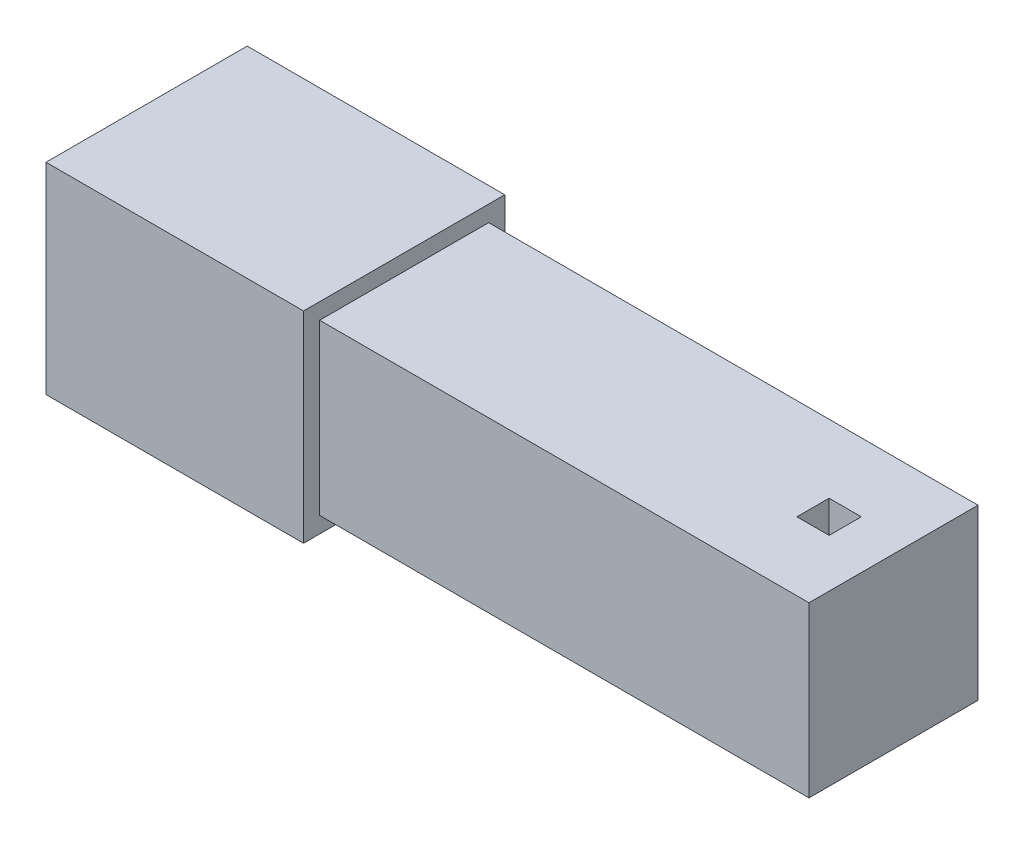
ISO-10303-21;
HEADER;
FILE_DESCRIPTION(('STEP AP214'),'2;1');
FILE_NAME('part.step','',(''),(''),'','','');
FILE_SCHEMA(('AUTOMOTIVE_DESIGN { 1 0 10303 214 1 1 1 1 }'));
ENDSEC;
DATA;
#1=APPLICATION_CONTEXT('core data for automotive mechanical design processes');
#2=APPLICATION_PROTOCOL_DEFINITION('international standard','automotive_design',2000,#1);
#3=PRODUCT_CONTEXT('',#1,'mechanical');
#4=PRODUCT('Part','Part','',(#3));
#5=PRODUCT_RELATED_PRODUCT_CATEGORY('part','',(#4));
#6=PRODUCT_DEFINITION_FORMATION('','',#4);
#7=PRODUCT_DEFINITION_CONTEXT('part definition',#1,'design');
#8=PRODUCT_DEFINITION('design','',#6,#7);
#9=PRODUCT_DEFINITION_SHAPE('','',#8);
#10=(LENGTH_UNIT() NAMED_UNIT(*) SI_UNIT(.MILLI.,.METRE.));
#11=(NAMED_UNIT(*) PLANE_ANGLE_UNIT() SI_UNIT($,.RADIAN.));
#12=(NAMED_UNIT(*) SI_UNIT($,.STERADIAN.) SOLID_ANGLE_UNIT());
#13=UNCERTAINTY_MEASURE_WITH_UNIT(LENGTH_MEASURE(1.E-05),#10,'distance_accuracy_value','');
#14=(GEOMETRIC_REPRESENTATION_CONTEXT(3) GLOBAL_UNCERTAINTY_ASSIGNED_CONTEXT((#13)) GLOBAL_UNIT_ASSIGNED_CONTEXT((#10,
#11,#12)) REPRESENTATION_CONTEXT('',''));
#15=CARTESIAN_POINT('',(0.,0.,0.));
#16=DIRECTION('',(0.,0.,1.));
#17=DIRECTION('',(1.,0.,0.));
#18=AXIS2_PLACEMENT_3D('',#15,#16,#17);
#19=CARTESIAN_POINT('',(-160.,0.,0.));
#20=DIRECTION('',(-1.,0.,0.));
#21=DIRECTION('',(0.,0.,1.));
#22=AXIS2_PLACEMENT_3D('',#19,#20,#21);
#23=PLANE('',#22);
#24=DIRECTION('',(0.,1.,0.));
#25=VECTOR('',#24,1.);
#26=CARTESIAN_POINT('',(-160.,0.,62.5));
#27=LINE('',#26,#25);
#28=CARTESIAN_POINT('',(-160.,-62.5,62.5));
#29=VERTEX_POINT('',#28);
#30=CARTESIAN_POINT('',(-160.,62.5,62.5));
#31=VERTEX_POINT('',#30);
#32=EDGE_CURVE('E180',#29,#31,#27,.T.);
#33=ORIENTED_EDGE('',*,*,#32,.T.);
#34=DIRECTION('',(0.,0.,-1.));
#35=VECTOR('',#34,1.);
#36=CARTESIAN_POINT('',(-160.,62.5,0.));
#37=LINE('',#36,#35);
#38=CARTESIAN_POINT('',(-160.,62.5,-62.5));
#39=VERTEX_POINT('',#38);
#40=EDGE_CURVE('E183',#31,#39,#37,.T.);
#41=ORIENTED_EDGE('',*,*,#40,.T.);
#42=DIRECTION('',(0.,-1.,0.));
#43=VECTOR('',#42,1.);
#44=CARTESIAN_POINT('',(-160.,0.,-62.5));
#45=LINE('',#44,#43);
#46=CARTESIAN_POINT('',(-160.,-62.5,-62.5));
#47=VERTEX_POINT('',#46);
#48=EDGE_CURVE('E186',#39,#47,#45,.T.);
#49=ORIENTED_EDGE('',*,*,#48,.T.);
#50=DIRECTION('',(0.,0.,1.));
#51=VECTOR('',#50,1.);
#52=CARTESIAN_POINT('',(-160.,-62.5,0.));
#53=LINE('',#52,#51);
#54=EDGE_CURVE('E188',#47,#29,#53,.T.);
#55=ORIENTED_EDGE('',*,*,#54,.T.);
#56=EDGE_LOOP('',(#33,#41,#49,#55));
#57=FACE_BOUND('',#56,.T.);
#58=DIRECTION('',(0.,0.,-1.));
#59=VECTOR('',#58,1.);
#60=CARTESIAN_POINT('',(-160.,52.5,-52.5));
#61=LINE('',#60,#59);
#62=CARTESIAN_POINT('',(-160.,52.5,52.5));
#63=VERTEX_POINT('',#62);
#64=CARTESIAN_POINT('',(-160.,52.5,-52.5));
#65=VERTEX_POINT('',#64);
#66=EDGE_CURVE('E152',#63,#65,#61,.T.);
#67=ORIENTED_EDGE('',*,*,#66,.F.);
#68=DIRECTION('',(0.,1.,0.));
#69=VECTOR('',#68,1.);
#70=CARTESIAN_POINT('',(-160.,-52.5,52.5));
#71=LINE('',#70,#69);
#72=CARTESIAN_POINT('',(-160.,-52.5,52.5));
#73=VERTEX_POINT('',#72);
#74=EDGE_CURVE('E144',#73,#63,#71,.T.);
#75=ORIENTED_EDGE('',*,*,#74,.F.);
#76=DIRECTION('',(0.,0.,1.));
#77=VECTOR('',#76,1.);
#78=CARTESIAN_POINT('',(-160.,-52.5,-52.5));
#79=LINE('',#78,#77);
#80=CARTESIAN_POINT('',(-160.,-52.5,-52.5));
#81=VERTEX_POINT('',#80);
#82=EDGE_CURVE('E166',#81,#73,#79,.T.);
#83=ORIENTED_EDGE('',*,*,#82,.F.);
#84=DIRECTION('',(0.,-1.,0.));
#85=VECTOR('',#84,1.);
#86=CARTESIAN_POINT('',(-160.,-52.5,-52.5));
#87=LINE('',#86,#85);
#88=EDGE_CURVE('E164',#65,#81,#87,.T.);
#89=ORIENTED_EDGE('',*,*,#88,.F.);
#90=EDGE_LOOP('',(#67,#75,#83,#89));
#91=FACE_BOUND('',#90,.T.);
#92=ADVANCED_FACE('F79',(#57,#91),#23,.T.);
#93=CARTESIAN_POINT('',(0.,0.,0.));
#94=DIRECTION('',(-1.,0.,0.));
#95=DIRECTION('',(0.,0.,1.));
#96=AXIS2_PLACEMENT_3D('',#93,#94,#95);
#97=PLANE('',#96);
#98=DIRECTION('',(0.,1.,0.));
#99=VECTOR('',#98,1.);
#100=CARTESIAN_POINT('',(0.,0.,62.5));
#101=LINE('',#100,#99);
#102=CARTESIAN_POINT('',(0.,-62.5,62.5));
#103=VERTEX_POINT('',#102);
#104=CARTESIAN_POINT('',(0.,62.5,62.5));
#105=VERTEX_POINT('',#104);
#106=EDGE_CURVE('E160',#103,#105,#101,.T.);
#107=ORIENTED_EDGE('',*,*,#106,.F.);
#108=DIRECTION('',(0.,0.,1.));
#109=VECTOR('',#108,1.);
#110=CARTESIAN_POINT('',(0.,-62.5,0.));
#111=LINE('',#110,#109);
#112=CARTESIAN_POINT('',(0.,-62.5,-62.5));
#113=VERTEX_POINT('',#112);
#114=EDGE_CURVE('E184',#113,#103,#111,.T.);
#115=ORIENTED_EDGE('',*,*,#114,.F.);
#116=DIRECTION('',(0.,-1.,0.));
#117=VECTOR('',#116,1.);
#118=CARTESIAN_POINT('',(0.,0.,-62.5));
#119=LINE('',#118,#117);
#120=CARTESIAN_POINT('',(0.,62.5,-62.5));
#121=VERTEX_POINT('',#120);
#122=EDGE_CURVE('E195',#121,#113,#119,.T.);
#123=ORIENTED_EDGE('',*,*,#122,.F.);
#124=DIRECTION('',(0.,0.,-1.));
#125=VECTOR('',#124,1.);
#126=CARTESIAN_POINT('',(0.,62.5,0.));
#127=LINE('',#126,#125);
#128=EDGE_CURVE('E193',#105,#121,#127,.T.);
#129=ORIENTED_EDGE('',*,*,#128,.F.);
#130=EDGE_LOOP('',(#107,#115,#123,#129));
#131=FACE_BOUND('',#130,.T.);
#132=DIRECTION('',(0.,1.,0.));
#133=VECTOR('',#132,1.);
#134=CARTESIAN_POINT('',(0.,-52.5,52.5));
#135=LINE('',#134,#133);
#136=CARTESIAN_POINT('',(0.,-52.5,52.5));
#137=VERTEX_POINT('',#136);
#138=CARTESIAN_POINT('',(0.,52.5,52.5));
#139=VERTEX_POINT('',#138);
#140=EDGE_CURVE('E102',#137,#139,#135,.T.);
#141=ORIENTED_EDGE('',*,*,#140,.T.);
#142=DIRECTION('',(0.,0.,-1.));
#143=VECTOR('',#142,1.);
#144=CARTESIAN_POINT('',(0.,52.5,-52.5));
#145=LINE('',#144,#143);
#146=CARTESIAN_POINT('',(0.,52.5,-52.5));
#147=VERTEX_POINT('',#146);
#148=EDGE_CURVE('E159',#139,#147,#145,.T.);
#149=ORIENTED_EDGE('',*,*,#148,.T.);
#150=DIRECTION('',(0.,-1.,0.));
#151=VECTOR('',#150,1.);
#152=CARTESIAN_POINT('',(0.,-52.5,-52.5));
#153=LINE('',#152,#151);
#154=CARTESIAN_POINT('',(0.,-52.5,-52.5));
#155=VERTEX_POINT('',#154);
#156=EDGE_CURVE('E172',#147,#155,#153,.T.);
#157=ORIENTED_EDGE('',*,*,#156,.T.);
#158=DIRECTION('',(0.,0.,1.));
#159=VECTOR('',#158,1.);
#160=CARTESIAN_POINT('',(0.,-52.5,-52.5));
#161=LINE('',#160,#159);
#162=EDGE_CURVE('E153',#155,#137,#161,.T.);
#163=ORIENTED_EDGE('',*,*,#162,.T.);
#164=EDGE_LOOP('',(#141,#149,#157,#163));
#165=FACE_BOUND('',#164,.T.);
#166=ADVANCED_FACE('F213',(#131,#165),#97,.F.);
#167=CARTESIAN_POINT('',(-160.,0.,62.5));
#168=DIRECTION('',(0.,0.,-1.));
#169=DIRECTION('',(-1.,0.,0.));
#170=AXIS2_PLACEMENT_3D('',#167,#168,#169);
#171=PLANE('',#170);
#172=ORIENTED_EDGE('',*,*,#106,.T.);
#173=DIRECTION('',(1.,0.,0.));
#174=VECTOR('',#173,1.);
#175=CARTESIAN_POINT('',(-160.,62.5,62.5));
#176=LINE('',#175,#174);
#177=EDGE_CURVE('E13',#31,#105,#176,.T.);
#178=ORIENTED_EDGE('',*,*,#177,.F.);
#179=ORIENTED_EDGE('',*,*,#32,.F.);
#180=DIRECTION('',(1.,0.,0.));
#181=VECTOR('',#180,1.);
#182=CARTESIAN_POINT('',(-160.,-62.5,62.5));
#183=LINE('',#182,#181);
#184=EDGE_CURVE('E190',#29,#103,#183,.T.);
#185=ORIENTED_EDGE('',*,*,#184,.T.);
#186=EDGE_LOOP('',(#172,#178,#179,#185));
#187=FACE_BOUND('',#186,.T.);
#188=ADVANCED_FACE('F81',(#187),#171,.F.);
#189=CARTESIAN_POINT('',(-160.,62.5,0.));
#190=DIRECTION('',(0.,-1.,0.));
#191=DIRECTION('',(0.,0.,-1.));
#192=AXIS2_PLACEMENT_3D('',#189,#190,#191);
#193=PLANE('',#192);
#194=ORIENTED_EDGE('',*,*,#128,.T.);
#195=DIRECTION('',(1.,0.,0.));
#196=VECTOR('',#195,1.);
#197=CARTESIAN_POINT('',(-160.,62.5,-62.5));
#198=LINE('',#197,#196);
#199=EDGE_CURVE('E87',#39,#121,#198,.T.);
#200=ORIENTED_EDGE('',*,*,#199,.F.);
#201=ORIENTED_EDGE('',*,*,#40,.F.);
#202=ORIENTED_EDGE('',*,*,#177,.T.);
#203=EDGE_LOOP('',(#194,#200,#201,#202));
#204=FACE_BOUND('',#203,.T.);
#205=ADVANCED_FACE('F223',(#204),#193,.F.);
#206=CARTESIAN_POINT('',(-160.,0.,-62.5));
#207=DIRECTION('',(0.,0.,1.));
#208=DIRECTION('',(1.,0.,0.));
#209=AXIS2_PLACEMENT_3D('',#206,#207,#208);
#210=PLANE('',#209);
#211=ORIENTED_EDGE('',*,*,#122,.T.);
#212=DIRECTION('',(1.,0.,0.));
#213=VECTOR('',#212,1.);
#214=CARTESIAN_POINT('',(-160.,-62.5,-62.5));
#215=LINE('',#214,#213);
#216=EDGE_CURVE('E200',#47,#113,#215,.T.);
#217=ORIENTED_EDGE('',*,*,#216,.F.);
#218=ORIENTED_EDGE('',*,*,#48,.F.);
#219=ORIENTED_EDGE('',*,*,#199,.T.);
#220=EDGE_LOOP('',(#211,#217,#218,#219));
#221=FACE_BOUND('',#220,.T.);
#222=ADVANCED_FACE('F207',(#221),#210,.F.);
#223=CARTESIAN_POINT('',(-160.,-62.5,0.));
#224=DIRECTION('',(0.,1.,0.));
#225=DIRECTION('',(0.,0.,1.));
#226=AXIS2_PLACEMENT_3D('',#223,#224,#225);
#227=PLANE('',#226);
#228=ORIENTED_EDGE('',*,*,#114,.T.);
#229=ORIENTED_EDGE('',*,*,#184,.F.);
#230=ORIENTED_EDGE('',*,*,#54,.F.);
#231=ORIENTED_EDGE('',*,*,#216,.T.);
#232=EDGE_LOOP('',(#228,#229,#230,#231));
#233=FACE_BOUND('',#232,.T.);
#234=ADVANCED_FACE('F217',(#233),#227,.F.);
#235=CARTESIAN_POINT('',(-160.,-52.5,52.5));
#236=DIRECTION('',(0.,0.,-1.));
#237=DIRECTION('',(-1.,0.,0.));
#238=AXIS2_PLACEMENT_3D('',#235,#236,#237);
#239=PLANE('',#238);
#240=ORIENTED_EDGE('',*,*,#140,.F.);
#241=DIRECTION('',(1.,0.,0.));
#242=VECTOR('',#241,1.);
#243=CARTESIAN_POINT('',(-160.,-52.5,52.5));
#244=LINE('',#243,#242);
#245=EDGE_CURVE('E148',#73,#137,#244,.T.);
#246=ORIENTED_EDGE('',*,*,#245,.F.);
#247=ORIENTED_EDGE('',*,*,#74,.T.);
#248=DIRECTION('',(1.,0.,0.));
#249=VECTOR('',#248,1.);
#250=CARTESIAN_POINT('',(-160.,52.5,52.5));
#251=LINE('',#250,#249);
#252=EDGE_CURVE('E147',#63,#139,#251,.T.);
#253=ORIENTED_EDGE('',*,*,#252,.T.);
#254=EDGE_LOOP('',(#240,#246,#247,#253));
#255=FACE_BOUND('',#254,.T.);
#256=ADVANCED_FACE('F146',(#255),#239,.T.);
#257=CARTESIAN_POINT('',(-160.,52.5,-52.5));
#258=DIRECTION('',(0.,-1.,0.));
#259=DIRECTION('',(0.,0.,-1.));
#260=AXIS2_PLACEMENT_3D('',#257,#258,#259);
#261=PLANE('',#260);
#262=ORIENTED_EDGE('',*,*,#148,.F.);
#263=ORIENTED_EDGE('',*,*,#252,.F.);
#264=ORIENTED_EDGE('',*,*,#66,.T.);
#265=DIRECTION('',(1.,0.,0.));
#266=VECTOR('',#265,1.);
#267=CARTESIAN_POINT('',(-160.,52.5,-52.5));
#268=LINE('',#267,#266);
#269=EDGE_CURVE('E161',#65,#147,#268,.T.);
#270=ORIENTED_EDGE('',*,*,#269,.T.);
#271=EDGE_LOOP('',(#262,#263,#264,#270));
#272=FACE_BOUND('',#271,.T.);
#273=ADVANCED_FACE('F156',(#272),#261,.T.);
#274=CARTESIAN_POINT('',(-160.,-52.5,-52.5));
#275=DIRECTION('',(0.,0.,1.));
#276=DIRECTION('',(1.,0.,0.));
#277=AXIS2_PLACEMENT_3D('',#274,#275,#276);
#278=PLANE('',#277);
#279=ORIENTED_EDGE('',*,*,#156,.F.);
#280=ORIENTED_EDGE('',*,*,#269,.F.);
#281=ORIENTED_EDGE('',*,*,#88,.T.);
#282=DIRECTION('',(1.,0.,0.));
#283=VECTOR('',#282,1.);
#284=CARTESIAN_POINT('',(-160.,-52.5,-52.5));
#285=LINE('',#284,#283);
#286=EDGE_CURVE('E94',#81,#155,#285,.T.);
#287=ORIENTED_EDGE('',*,*,#286,.T.);
#288=EDGE_LOOP('',(#279,#280,#281,#287));
#289=FACE_BOUND('',#288,.T.);
#290=ADVANCED_FACE('F246',(#289),#278,.T.);
#291=CARTESIAN_POINT('',(-160.,-52.5,-52.5));
#292=DIRECTION('',(0.,1.,0.));
#293=DIRECTION('',(0.,0.,1.));
#294=AXIS2_PLACEMENT_3D('',#291,#292,#293);
#295=PLANE('',#294);
#296=ORIENTED_EDGE('',*,*,#162,.F.);
#297=ORIENTED_EDGE('',*,*,#286,.F.);
#298=ORIENTED_EDGE('',*,*,#82,.T.);
#299=ORIENTED_EDGE('',*,*,#245,.T.);
#300=EDGE_LOOP('',(#296,#297,#298,#299));
#301=FACE_BOUND('',#300,.T.);
#302=ADVANCED_FACE('F250',(#301),#295,.T.);
#303=CLOSED_SHELL('',(#92,#166,#188,#205,#222,#234,#256,#273,#290,#302));
#304=MANIFOLD_SOLID_BREP('B2',#303);
#305=CARTESIAN_POINT('',(304.,52.5,52.5));
#306=DIRECTION('',(0.,1.,0.));
#307=DIRECTION('',(0.,0.,1.));
#308=AXIS2_PLACEMENT_3D('',#305,#306,#307);
#309=PLANE('',#308);
#310=DIRECTION('',(0.,0.,-1.));
#311=VECTOR('',#310,1.);
#312=CARTESIAN_POINT('',(274.,52.5,52.5));
#313=LINE('',#312,#311);
#314=CARTESIAN_POINT('',(274.,52.5,9.99999999999999));
#315=VERTEX_POINT('',#314);
#316=CARTESIAN_POINT('',(274.,52.5,-10.));
#317=VERTEX_POINT('',#316);
#318=EDGE_CURVE('E442',#315,#317,#313,.T.);
#319=ORIENTED_EDGE('',*,*,#318,.F.);
#320=DIRECTION('',(1.,0.,0.));
#321=VECTOR('',#320,1.);
#322=CARTESIAN_POINT('',(304.,52.5,9.99999999999999));
#323=LINE('',#322,#321);
#324=CARTESIAN_POINT('',(254.,52.5,9.99999999999999));
#325=VERTEX_POINT('',#324);
#326=EDGE_CURVE('E430',#325,#315,#323,.T.);
#327=ORIENTED_EDGE('',*,*,#326,.F.);
#328=DIRECTION('',(0.,0.,1.));
#329=VECTOR('',#328,1.);
#330=CARTESIAN_POINT('',(254.,52.5,52.5));
#331=LINE('',#330,#329);
#332=CARTESIAN_POINT('',(254.,52.5,-10.));
#333=VERTEX_POINT('',#332);
#334=EDGE_CURVE('E405',#333,#325,#331,.T.);
#335=ORIENTED_EDGE('',*,*,#334,.F.);
#336=DIRECTION('',(-1.,0.,0.));
#337=VECTOR('',#336,1.);
#338=CARTESIAN_POINT('',(304.,52.5,-10.));
#339=LINE('',#338,#337);
#340=EDGE_CURVE('E439',#317,#333,#339,.T.);
#341=ORIENTED_EDGE('',*,*,#340,.F.);
#342=EDGE_LOOP('',(#319,#327,#335,#341));
#343=FACE_BOUND('',#342,.T.);
#344=DIRECTION('',(0.,0.,-1.));
#345=VECTOR('',#344,1.);
#346=CARTESIAN_POINT('',(0.,52.5,52.5));
#347=LINE('',#346,#345);
#348=CARTESIAN_POINT('',(0.,52.5,52.5));
#349=VERTEX_POINT('',#348);
#350=CARTESIAN_POINT('',(0.,52.5,-52.5));
#351=VERTEX_POINT('',#350);
#352=EDGE_CURVE('E490',#349,#351,#347,.T.);
#353=ORIENTED_EDGE('',*,*,#352,.F.);
#354=DIRECTION('',(-1.,0.,0.));
#355=VECTOR('',#354,1.);
#356=CARTESIAN_POINT('',(304.,52.5,52.5));
#357=LINE('',#356,#355);
#358=CARTESIAN_POINT('',(304.,52.5,52.5));
#359=VERTEX_POINT('',#358);
#360=EDGE_CURVE('E77',#359,#349,#357,.T.);
#361=ORIENTED_EDGE('',*,*,#360,.F.);
#362=DIRECTION('',(0.,0.,-1.));
#363=VECTOR('',#362,1.);
#364=CARTESIAN_POINT('',(304.,52.5,52.5));
#365=LINE('',#364,#363);
#366=CARTESIAN_POINT('',(304.,52.5,-52.5));
#367=VERTEX_POINT('',#366);
#368=EDGE_CURVE('E491',#359,#367,#365,.T.);
#369=ORIENTED_EDGE('',*,*,#368,.T.);
#370=DIRECTION('',(-1.,0.,0.));
#371=VECTOR('',#370,1.);
#372=CARTESIAN_POINT('',(304.,52.5,-52.5));
#373=LINE('',#372,#371);
#374=EDGE_CURVE('E312',#367,#351,#373,.T.);
#375=ORIENTED_EDGE('',*,*,#374,.T.);
#376=EDGE_LOOP('',(#353,#361,#369,#375));
#377=FACE_BOUND('',#376,.T.);
#378=ADVANCED_FACE('F309',(#343,#377),#309,.T.);
#379=CARTESIAN_POINT('',(304.,52.5,52.5));
#380=DIRECTION('',(0.,0.,-1.));
#381=DIRECTION('',(0.,1.,0.));
#382=AXIS2_PLACEMENT_3D('',#379,#380,#381);
#383=PLANE('',#382);
#384=DIRECTION('',(0.,-1.,0.));
#385=VECTOR('',#384,1.);
#386=CARTESIAN_POINT('',(0.,52.5,52.5));
#387=LINE('',#386,#385);
#388=CARTESIAN_POINT('',(0.,-52.5,52.5));
#389=VERTEX_POINT('',#388);
#390=EDGE_CURVE('E496',#349,#389,#387,.T.);
#391=ORIENTED_EDGE('',*,*,#390,.T.);
#392=DIRECTION('',(-1.,0.,0.));
#393=VECTOR('',#392,1.);
#394=CARTESIAN_POINT('',(304.,-52.5,52.5));
#395=LINE('',#394,#393);
#396=CARTESIAN_POINT('',(304.,-52.5,52.5));
#397=VERTEX_POINT('',#396);
#398=EDGE_CURVE('E318',#397,#389,#395,.T.);
#399=ORIENTED_EDGE('',*,*,#398,.F.);
#400=DIRECTION('',(0.,-1.,0.));
#401=VECTOR('',#400,1.);
#402=CARTESIAN_POINT('',(304.,52.5,52.5));
#403=LINE('',#402,#401);
#404=EDGE_CURVE('E503',#359,#397,#403,.T.);
#405=ORIENTED_EDGE('',*,*,#404,.F.);
#406=ORIENTED_EDGE('',*,*,#360,.T.);
#407=EDGE_LOOP('',(#391,#399,#405,#406));
#408=FACE_BOUND('',#407,.T.);
#409=ADVANCED_FACE('F538',(#408),#383,.F.);
#410=CARTESIAN_POINT('',(304.,-52.5,52.5));
#411=DIRECTION('',(0.,1.,0.));
#412=DIRECTION('',(0.,0.,1.));
#413=AXIS2_PLACEMENT_3D('',#410,#411,#412);
#414=PLANE('',#413);
#415=DIRECTION('',(-1.,0.,0.));
#416=VECTOR('',#415,1.);
#417=CARTESIAN_POINT('',(254.,-52.5,9.99999999999999));
#418=LINE('',#417,#416);
#419=CARTESIAN_POINT('',(274.,-52.5,9.99999999999999));
#420=VERTEX_POINT('',#419);
#421=CARTESIAN_POINT('',(254.,-52.5,9.99999999999999));
#422=VERTEX_POINT('',#421);
#423=EDGE_CURVE('E412',#420,#422,#418,.T.);
#424=ORIENTED_EDGE('',*,*,#423,.F.);
#425=DIRECTION('',(0.,0.,1.));
#426=VECTOR('',#425,1.);
#427=CARTESIAN_POINT('',(274.,-52.5,9.99999999999999));
#428=LINE('',#427,#426);
#429=CARTESIAN_POINT('',(274.,-52.5,-10.));
#430=VERTEX_POINT('',#429);
#431=EDGE_CURVE('E334',#430,#420,#428,.T.);
#432=ORIENTED_EDGE('',*,*,#431,.F.);
#433=DIRECTION('',(1.,0.,0.));
#434=VECTOR('',#433,1.);
#435=CARTESIAN_POINT('',(254.,-52.5,-10.));
#436=LINE('',#435,#434);
#437=CARTESIAN_POINT('',(254.,-52.5,-10.));
#438=VERTEX_POINT('',#437);
#439=EDGE_CURVE('E420',#438,#430,#436,.T.);
#440=ORIENTED_EDGE('',*,*,#439,.F.);
#441=DIRECTION('',(0.,0.,-1.));
#442=VECTOR('',#441,1.);
#443=CARTESIAN_POINT('',(254.,-52.5,9.99999999999999));
#444=LINE('',#443,#442);
#445=EDGE_CURVE('E402',#422,#438,#444,.T.);
#446=ORIENTED_EDGE('',*,*,#445,.F.);
#447=EDGE_LOOP('',(#424,#432,#440,#446));
#448=FACE_BOUND('',#447,.T.);
#449=DIRECTION('',(0.,0.,-1.));
#450=VECTOR('',#449,1.);
#451=CARTESIAN_POINT('',(0.,-52.5,52.5));
#452=LINE('',#451,#450);
#453=CARTESIAN_POINT('',(0.,-52.5,-52.5));
#454=VERTEX_POINT('',#453);
#455=EDGE_CURVE('E513',#389,#454,#452,.T.);
#456=ORIENTED_EDGE('',*,*,#455,.T.);
#457=DIRECTION('',(-1.,0.,0.));
#458=VECTOR('',#457,1.);
#459=CARTESIAN_POINT('',(304.,-52.5,-52.5));
#460=LINE('',#459,#458);
#461=CARTESIAN_POINT('',(304.,-52.5,-52.5));
#462=VERTEX_POINT('',#461);
#463=EDGE_CURVE('E521',#462,#454,#460,.T.);
#464=ORIENTED_EDGE('',*,*,#463,.F.);
#465=DIRECTION('',(0.,0.,-1.));
#466=VECTOR('',#465,1.);
#467=CARTESIAN_POINT('',(304.,-52.5,52.5));
#468=LINE('',#467,#466);
#469=EDGE_CURVE('E500',#397,#462,#468,.T.);
#470=ORIENTED_EDGE('',*,*,#469,.F.);
#471=ORIENTED_EDGE('',*,*,#398,.T.);
#472=EDGE_LOOP('',(#456,#464,#470,#471));
#473=FACE_BOUND('',#472,.T.);
#474=ADVANCED_FACE('F417',(#448,#473),#414,.F.);
#475=CARTESIAN_POINT('',(304.,52.5,-52.5));
#476=DIRECTION('',(0.,0.,-1.));
#477=DIRECTION('',(0.,1.,0.));
#478=AXIS2_PLACEMENT_3D('',#475,#476,#477);
#479=PLANE('',#478);
#480=DIRECTION('',(0.,-1.,0.));
#481=VECTOR('',#480,1.);
#482=CARTESIAN_POINT('',(0.,52.5,-52.5));
#483=LINE('',#482,#481);
#484=EDGE_CURVE('E509',#351,#454,#483,.T.);
#485=ORIENTED_EDGE('',*,*,#484,.F.);
#486=ORIENTED_EDGE('',*,*,#374,.F.);
#487=DIRECTION('',(0.,-1.,0.));
#488=VECTOR('',#487,1.);
#489=CARTESIAN_POINT('',(304.,52.5,-52.5));
#490=LINE('',#489,#488);
#491=EDGE_CURVE('E495',#367,#462,#490,.T.);
#492=ORIENTED_EDGE('',*,*,#491,.T.);
#493=ORIENTED_EDGE('',*,*,#463,.T.);
#494=EDGE_LOOP('',(#485,#486,#492,#493));
#495=FACE_BOUND('',#494,.T.);
#496=ADVANCED_FACE('F531',(#495),#479,.T.);
#497=CARTESIAN_POINT('',(304.,0.,0.));
#498=DIRECTION('',(-1.,0.,0.));
#499=DIRECTION('',(0.,0.,1.));
#500=AXIS2_PLACEMENT_3D('',#497,#498,#499);
#501=PLANE('',#500);
#502=ORIENTED_EDGE('',*,*,#368,.F.);
#503=ORIENTED_EDGE('',*,*,#404,.T.);
#504=ORIENTED_EDGE('',*,*,#469,.T.);
#505=ORIENTED_EDGE('',*,*,#491,.F.);
#506=EDGE_LOOP('',(#502,#503,#504,#505));
#507=FACE_BOUND('',#506,.T.);
#508=ADVANCED_FACE('F542',(#507),#501,.F.);
#509=CARTESIAN_POINT('',(0.,0.,0.));
#510=DIRECTION('',(-1.,0.,0.));
#511=DIRECTION('',(0.,0.,1.));
#512=AXIS2_PLACEMENT_3D('',#509,#510,#511);
#513=PLANE('',#512);
#514=DIRECTION('',(0.,1.,0.));
#515=VECTOR('',#514,1.);
#516=CARTESIAN_POINT('',(0.,10.,10.));
#517=LINE('',#516,#515);
#518=CARTESIAN_POINT('',(0.,-10.,10.));
#519=VERTEX_POINT('',#518);
#520=CARTESIAN_POINT('',(0.,10.,10.));
#521=VERTEX_POINT('',#520);
#522=EDGE_CURVE('E445',#519,#521,#517,.T.);
#523=ORIENTED_EDGE('',*,*,#522,.F.);
#524=DIRECTION('',(0.,0.,1.));
#525=VECTOR('',#524,1.);
#526=CARTESIAN_POINT('',(0.,-10.,-10.));
#527=LINE('',#526,#525);
#528=CARTESIAN_POINT('',(0.,-10.,-10.));
#529=VERTEX_POINT('',#528);
#530=EDGE_CURVE('E451',#529,#519,#527,.T.);
#531=ORIENTED_EDGE('',*,*,#530,.F.);
#532=DIRECTION('',(0.,-1.,0.));
#533=VECTOR('',#532,1.);
#534=CARTESIAN_POINT('',(0.,10.,-10.));
#535=LINE('',#534,#533);
#536=CARTESIAN_POINT('',(0.,10.,-10.));
#537=VERTEX_POINT('',#536);
#538=EDGE_CURVE('E468',#537,#529,#535,.T.);
#539=ORIENTED_EDGE('',*,*,#538,.F.);
#540=DIRECTION('',(0.,0.,-1.));
#541=VECTOR('',#540,1.);
#542=CARTESIAN_POINT('',(0.,10.,-10.));
#543=LINE('',#542,#541);
#544=EDGE_CURVE('E464',#521,#537,#543,.T.);
#545=ORIENTED_EDGE('',*,*,#544,.F.);
#546=EDGE_LOOP('',(#523,#531,#539,#545));
#547=FACE_BOUND('',#546,.T.);
#548=ORIENTED_EDGE('',*,*,#352,.T.);
#549=ORIENTED_EDGE('',*,*,#484,.T.);
#550=ORIENTED_EDGE('',*,*,#455,.F.);
#551=ORIENTED_EDGE('',*,*,#390,.F.);
#552=EDGE_LOOP('',(#548,#549,#550,#551));
#553=FACE_BOUND('',#552,.T.);
#554=ADVANCED_FACE('F535',(#547,#553),#513,.T.);
#555=CARTESIAN_POINT('',(-152.,10.,10.));
#556=DIRECTION('',(0.,0.,-1.));
#557=DIRECTION('',(0.,1.,0.));
#558=AXIS2_PLACEMENT_3D('',#555,#556,#557);
#559=PLANE('',#558);
#560=ORIENTED_EDGE('',*,*,#522,.T.);
#561=DIRECTION('',(1.,0.,0.));
#562=VECTOR('',#561,1.);
#563=CARTESIAN_POINT('',(-152.,10.,10.));
#564=LINE('',#563,#562);
#565=CARTESIAN_POINT('',(-152.,10.,10.));
#566=VERTEX_POINT('',#565);
#567=EDGE_CURVE('E486',#566,#521,#564,.T.);
#568=ORIENTED_EDGE('',*,*,#567,.F.);
#569=DIRECTION('',(0.,1.,0.));
#570=VECTOR('',#569,1.);
#571=CARTESIAN_POINT('',(-152.,10.,10.));
#572=LINE('',#571,#570);
#573=CARTESIAN_POINT('',(-152.,-10.,10.));
#574=VERTEX_POINT('',#573);
#575=EDGE_CURVE('E446',#574,#566,#572,.T.);
#576=ORIENTED_EDGE('',*,*,#575,.F.);
#577=DIRECTION('',(1.,0.,0.));
#578=VECTOR('',#577,1.);
#579=CARTESIAN_POINT('',(-152.,-10.,10.));
#580=LINE('',#579,#578);
#581=EDGE_CURVE('E460',#574,#519,#580,.T.);
#582=ORIENTED_EDGE('',*,*,#581,.T.);
#583=EDGE_LOOP('',(#560,#568,#576,#582));
#584=FACE_BOUND('',#583,.T.);
#585=ADVANCED_FACE('F549',(#584),#559,.F.);
#586=CARTESIAN_POINT('',(-152.,10.,-10.));
#587=DIRECTION('',(0.,-1.,0.));
#588=DIRECTION('',(0.,0.,-1.));
#589=AXIS2_PLACEMENT_3D('',#586,#587,#588);
#590=PLANE('',#589);
#591=ORIENTED_EDGE('',*,*,#544,.T.);
#592=DIRECTION('',(1.,0.,0.));
#593=VECTOR('',#592,1.);
#594=CARTESIAN_POINT('',(-152.,10.,-10.));
#595=LINE('',#594,#593);
#596=CARTESIAN_POINT('',(-152.,10.,-10.));
#597=VERTEX_POINT('',#596);
#598=EDGE_CURVE('E482',#597,#537,#595,.T.);
#599=ORIENTED_EDGE('',*,*,#598,.F.);
#600=DIRECTION('',(0.,0.,-1.));
#601=VECTOR('',#600,1.);
#602=CARTESIAN_POINT('',(-152.,10.,-10.));
#603=LINE('',#602,#601);
#604=EDGE_CURVE('E450',#566,#597,#603,.T.);
#605=ORIENTED_EDGE('',*,*,#604,.F.);
#606=ORIENTED_EDGE('',*,*,#567,.T.);
#607=EDGE_LOOP('',(#591,#599,#605,#606));
#608=FACE_BOUND('',#607,.T.);
#609=ADVANCED_FACE('F589',(#608),#590,.F.);
#610=CARTESIAN_POINT('',(-152.,10.,-10.));
#611=DIRECTION('',(0.,0.,1.));
#612=DIRECTION('',(1.,0.,0.));
#613=AXIS2_PLACEMENT_3D('',#610,#611,#612);
#614=PLANE('',#613);
#615=ORIENTED_EDGE('',*,*,#538,.T.);
#616=DIRECTION('',(1.,0.,0.));
#617=VECTOR('',#616,1.);
#618=CARTESIAN_POINT('',(-152.,-10.,-10.));
#619=LINE('',#618,#617);
#620=CARTESIAN_POINT('',(-152.,-10.,-10.));
#621=VERTEX_POINT('',#620);
#622=EDGE_CURVE('E478',#621,#529,#619,.T.);
#623=ORIENTED_EDGE('',*,*,#622,.F.);
#624=DIRECTION('',(0.,-1.,0.));
#625=VECTOR('',#624,1.);
#626=CARTESIAN_POINT('',(-152.,10.,-10.));
#627=LINE('',#626,#625);
#628=EDGE_CURVE('E454',#597,#621,#627,.T.);
#629=ORIENTED_EDGE('',*,*,#628,.F.);
#630=ORIENTED_EDGE('',*,*,#598,.T.);
#631=EDGE_LOOP('',(#615,#623,#629,#630));
#632=FACE_BOUND('',#631,.T.);
#633=ADVANCED_FACE('F585',(#632),#614,.F.);
#634=CARTESIAN_POINT('',(-152.,-10.,-10.));
#635=DIRECTION('',(0.,1.,0.));
#636=DIRECTION('',(0.,0.,1.));
#637=AXIS2_PLACEMENT_3D('',#634,#635,#636);
#638=PLANE('',#637);
#639=ORIENTED_EDGE('',*,*,#530,.T.);
#640=ORIENTED_EDGE('',*,*,#581,.F.);
#641=DIRECTION('',(0.,0.,1.));
#642=VECTOR('',#641,1.);
#643=CARTESIAN_POINT('',(-152.,-10.,-10.));
#644=LINE('',#643,#642);
#645=EDGE_CURVE('E457',#621,#574,#644,.T.);
#646=ORIENTED_EDGE('',*,*,#645,.F.);
#647=ORIENTED_EDGE('',*,*,#622,.T.);
#648=EDGE_LOOP('',(#639,#640,#646,#647));
#649=FACE_BOUND('',#648,.T.);
#650=ADVANCED_FACE('F581',(#649),#638,.F.);
#651=CARTESIAN_POINT('',(-152.,0.,0.));
#652=DIRECTION('',(-1.,0.,0.));
#653=DIRECTION('',(0.,0.,1.));
#654=AXIS2_PLACEMENT_3D('',#651,#652,#653);
#655=PLANE('',#654);
#656=ORIENTED_EDGE('',*,*,#575,.T.);
#657=ORIENTED_EDGE('',*,*,#604,.T.);
#658=ORIENTED_EDGE('',*,*,#628,.T.);
#659=ORIENTED_EDGE('',*,*,#645,.T.);
#660=EDGE_LOOP('',(#656,#657,#658,#659));
#661=FACE_BOUND('',#660,.T.);
#662=ADVANCED_FACE('F575',(#661),#655,.T.);
#663=CARTESIAN_POINT('',(274.,107.5,9.99999999999999));
#664=DIRECTION('',(1.,0.,0.));
#665=DIRECTION('',(0.,0.,-1.));
#666=AXIS2_PLACEMENT_3D('',#663,#664,#665);
#667=PLANE('',#666);
#668=ORIENTED_EDGE('',*,*,#318,.T.);
#669=DIRECTION('',(0.,-1.,0.));
#670=VECTOR('',#669,1.);
#671=CARTESIAN_POINT('',(274.,107.5,-10.));
#672=LINE('',#671,#670);
#673=EDGE_CURVE('E427',#317,#430,#672,.T.);
#674=ORIENTED_EDGE('',*,*,#673,.T.);
#675=ORIENTED_EDGE('',*,*,#431,.T.);
#676=DIRECTION('',(0.,-1.,0.));
#677=VECTOR('',#676,1.);
#678=CARTESIAN_POINT('',(274.,107.5,9.99999999999999));
#679=LINE('',#678,#677);
#680=EDGE_CURVE('E409',#315,#420,#679,.T.);
#681=ORIENTED_EDGE('',*,*,#680,.F.);
#682=EDGE_LOOP('',(#668,#674,#675,#681));
#683=FACE_BOUND('',#682,.T.);
#684=ADVANCED_FACE('F564',(#683),#667,.F.);
#685=CARTESIAN_POINT('',(254.,107.5,-10.));
#686=DIRECTION('',(0.,0.,-1.));
#687=DIRECTION('',(-1.,0.,0.));
#688=AXIS2_PLACEMENT_3D('',#685,#686,#687);
#689=PLANE('',#688);
#690=ORIENTED_EDGE('',*,*,#340,.T.);
#691=DIRECTION('',(0.,-1.,0.));
#692=VECTOR('',#691,1.);
#693=CARTESIAN_POINT('',(254.,107.5,-10.));
#694=LINE('',#693,#692);
#695=EDGE_CURVE('E408',#333,#438,#694,.T.);
#696=ORIENTED_EDGE('',*,*,#695,.T.);
#697=ORIENTED_EDGE('',*,*,#439,.T.);
#698=ORIENTED_EDGE('',*,*,#673,.F.);
#699=EDGE_LOOP('',(#690,#696,#697,#698));
#700=FACE_BOUND('',#699,.T.);
#701=ADVANCED_FACE('F566',(#700),#689,.F.);
#702=CARTESIAN_POINT('',(254.,107.5,9.99999999999999));
#703=DIRECTION('',(-1.,0.,0.));
#704=DIRECTION('',(0.,0.,1.));
#705=AXIS2_PLACEMENT_3D('',#702,#703,#704);
#706=PLANE('',#705);
#707=ORIENTED_EDGE('',*,*,#334,.T.);
#708=DIRECTION('',(0.,-1.,0.));
#709=VECTOR('',#708,1.);
#710=CARTESIAN_POINT('',(254.,107.5,9.99999999999999));
#711=LINE('',#710,#709);
#712=EDGE_CURVE('E326',#325,#422,#711,.T.);
#713=ORIENTED_EDGE('',*,*,#712,.T.);
#714=ORIENTED_EDGE('',*,*,#445,.T.);
#715=ORIENTED_EDGE('',*,*,#695,.F.);
#716=EDGE_LOOP('',(#707,#713,#714,#715));
#717=FACE_BOUND('',#716,.T.);
#718=ADVANCED_FACE('F399',(#717),#706,.F.);
#719=CARTESIAN_POINT('',(254.,107.5,9.99999999999999));
#720=DIRECTION('',(0.,0.,1.));
#721=DIRECTION('',(1.,0.,0.));
#722=AXIS2_PLACEMENT_3D('',#719,#720,#721);
#723=PLANE('',#722);
#724=ORIENTED_EDGE('',*,*,#326,.T.);
#725=ORIENTED_EDGE('',*,*,#680,.T.);
#726=ORIENTED_EDGE('',*,*,#423,.T.);
#727=ORIENTED_EDGE('',*,*,#712,.F.);
#728=EDGE_LOOP('',(#724,#725,#726,#727));
#729=FACE_BOUND('',#728,.T.);
#730=ADVANCED_FACE('F413',(#729),#723,.F.);
#731=CLOSED_SHELL('',(#378,#409,#474,#496,#508,#554,#585,#609,#633,#650,#662,#684,#701,#718,#730));
#732=MANIFOLD_SOLID_BREP('B7',#731);
#733=ADVANCED_BREP_SHAPE_REPRESENTATION('',(#18,#304,#732),#14);
#734=SHAPE_DEFINITION_REPRESENTATION(#9,#733);
ENDSEC;
END-ISO-10303-21;
